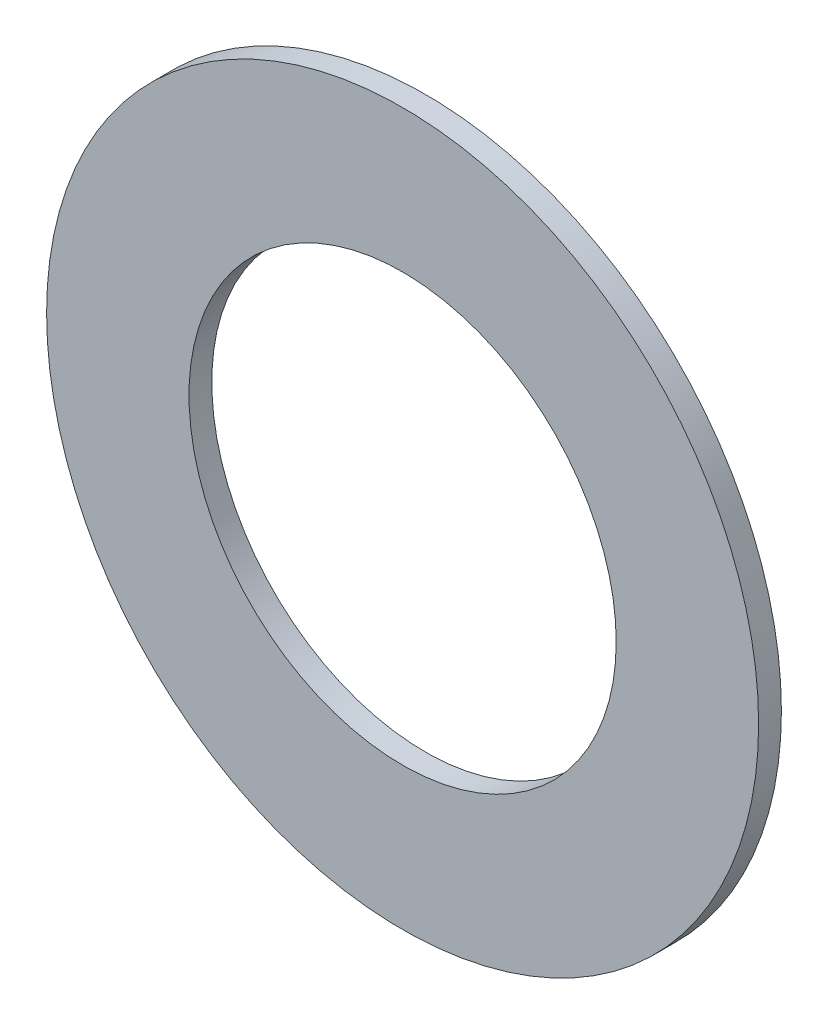
ISO-10303-21;
HEADER;
FILE_DESCRIPTION(('STEP AP214'),'2;1');
FILE_NAME('part.step','',(''),(''),'','','');
FILE_SCHEMA(('AUTOMOTIVE_DESIGN { 1 0 10303 214 1 1 1 1 }'));
ENDSEC;
DATA;
#1=APPLICATION_CONTEXT('core data for automotive mechanical design processes');
#2=APPLICATION_PROTOCOL_DEFINITION('international standard','automotive_design',2000,#1);
#3=PRODUCT_CONTEXT('',#1,'mechanical');
#4=PRODUCT('Part','Part','',(#3));
#5=PRODUCT_RELATED_PRODUCT_CATEGORY('part','',(#4));
#6=PRODUCT_DEFINITION_FORMATION('','',#4);
#7=PRODUCT_DEFINITION_CONTEXT('part definition',#1,'design');
#8=PRODUCT_DEFINITION('design','',#6,#7);
#9=PRODUCT_DEFINITION_SHAPE('','',#8);
#10=(LENGTH_UNIT() NAMED_UNIT(*) SI_UNIT(.MILLI.,.METRE.));
#11=(NAMED_UNIT(*) PLANE_ANGLE_UNIT() SI_UNIT($,.RADIAN.));
#12=(NAMED_UNIT(*) SI_UNIT($,.STERADIAN.) SOLID_ANGLE_UNIT());
#13=UNCERTAINTY_MEASURE_WITH_UNIT(LENGTH_MEASURE(1.E-05),#10,'distance_accuracy_value','');
#14=(GEOMETRIC_REPRESENTATION_CONTEXT(3) GLOBAL_UNCERTAINTY_ASSIGNED_CONTEXT((#13)) GLOBAL_UNIT_ASSIGNED_CONTEXT((#10,
#11,#12)) REPRESENTATION_CONTEXT('',''));
#15=CARTESIAN_POINT('',(0.,0.,0.));
#16=DIRECTION('',(0.,0.,1.));
#17=DIRECTION('',(1.,0.,0.));
#18=AXIS2_PLACEMENT_3D('',#15,#16,#17);
#19=CARTESIAN_POINT('',(0.,0.,-0.507999999999998));
#20=DIRECTION('',(0.,0.,1.));
#21=DIRECTION('',(1.,0.,0.));
#22=AXIS2_PLACEMENT_3D('',#19,#20,#21);
#23=CYLINDRICAL_SURFACE('',#22,7.9375);
#24=CARTESIAN_POINT('',(0.,0.,-0.507999999999998));
#25=DIRECTION('',(0.,0.,1.));
#26=DIRECTION('',(1.,0.,0.));
#27=AXIS2_PLACEMENT_3D('',#24,#25,#26);
#28=CIRCLE('',#27,7.9375);
#29=CARTESIAN_POINT('',(7.93750000000001,0.,-0.507999999999998));
#30=VERTEX_POINT('',#29);
#31=EDGE_CURVE('E10',#30,#30,#28,.T.);
#32=ORIENTED_EDGE('',*,*,#31,.T.);
#33=EDGE_LOOP('',(#32));
#34=FACE_BOUND('',#33,.T.);
#35=CARTESIAN_POINT('',(0.,0.,0.));
#36=DIRECTION('',(0.,0.,1.));
#37=DIRECTION('',(1.,0.,0.));
#38=AXIS2_PLACEMENT_3D('',#35,#36,#37);
#39=CIRCLE('',#38,7.9375);
#40=CARTESIAN_POINT('',(7.93750000000001,0.,0.));
#41=VERTEX_POINT('',#40);
#42=EDGE_CURVE('E37',#41,#41,#39,.T.);
#43=ORIENTED_EDGE('',*,*,#42,.F.);
#44=EDGE_LOOP('',(#43));
#45=FACE_BOUND('',#44,.T.);
#46=ADVANCED_FACE('F31',(#34,#45),#23,.T.);
#47=CARTESIAN_POINT('',(0.,0.,-0.507999999999998));
#48=DIRECTION('',(0.,0.,1.));
#49=DIRECTION('',(1.,0.,0.));
#50=AXIS2_PLACEMENT_3D('',#47,#48,#49);
#51=PLANE('',#50);
#52=CARTESIAN_POINT('',(0.,0.,-0.507999999999998));
#53=DIRECTION('',(0.,0.,1.));
#54=DIRECTION('',(1.,0.,0.));
#55=AXIS2_PLACEMENT_3D('',#52,#53,#54);
#56=CIRCLE('',#55,4.7625);
#57=CARTESIAN_POINT('',(4.7625,0.,-0.507999999999998));
#58=VERTEX_POINT('',#57);
#59=EDGE_CURVE('E41',#58,#58,#56,.T.);
#60=ORIENTED_EDGE('',*,*,#59,.T.);
#61=EDGE_LOOP('',(#60));
#62=FACE_BOUND('',#61,.T.);
#63=ORIENTED_EDGE('',*,*,#31,.F.);
#64=EDGE_LOOP('',(#63));
#65=FACE_BOUND('',#64,.T.);
#66=ADVANCED_FACE('F55',(#62,#65),#51,.F.);
#67=CARTESIAN_POINT('',(0.,0.,0.));
#68=DIRECTION('',(0.,0.,1.));
#69=DIRECTION('',(1.,0.,0.));
#70=AXIS2_PLACEMENT_3D('',#67,#68,#69);
#71=PLANE('',#70);
#72=CARTESIAN_POINT('',(0.,0.,0.));
#73=DIRECTION('',(0.,0.,1.));
#74=DIRECTION('',(1.,0.,0.));
#75=AXIS2_PLACEMENT_3D('',#72,#73,#74);
#76=CIRCLE('',#75,4.7625);
#77=CARTESIAN_POINT('',(4.7625,0.,0.));
#78=VERTEX_POINT('',#77);
#79=EDGE_CURVE('E45',#78,#78,#76,.T.);
#80=ORIENTED_EDGE('',*,*,#79,.F.);
#81=EDGE_LOOP('',(#80));
#82=FACE_BOUND('',#81,.T.);
#83=ORIENTED_EDGE('',*,*,#42,.T.);
#84=EDGE_LOOP('',(#83));
#85=FACE_BOUND('',#84,.T.);
#86=ADVANCED_FACE('F53',(#82,#85),#71,.T.);
#87=CARTESIAN_POINT('',(0.,0.,-0.507999999999998));
#88=DIRECTION('',(0.,0.,1.));
#89=DIRECTION('',(1.,0.,0.));
#90=AXIS2_PLACEMENT_3D('',#87,#88,#89);
#91=CYLINDRICAL_SURFACE('',#90,4.7625);
#92=ORIENTED_EDGE('',*,*,#59,.F.);
#93=EDGE_LOOP('',(#92));
#94=FACE_BOUND('',#93,.T.);
#95=ORIENTED_EDGE('',*,*,#79,.T.);
#96=EDGE_LOOP('',(#95));
#97=FACE_BOUND('',#96,.T.);
#98=ADVANCED_FACE('F51',(#94,#97),#91,.F.);
#99=CLOSED_SHELL('',(#46,#66,#86,#98));
#100=MANIFOLD_SOLID_BREP('B2',#99);
#101=ADVANCED_BREP_SHAPE_REPRESENTATION('',(#18,#100),#14);
#102=SHAPE_DEFINITION_REPRESENTATION(#9,#101);
ENDSEC;
END-ISO-10303-21;
